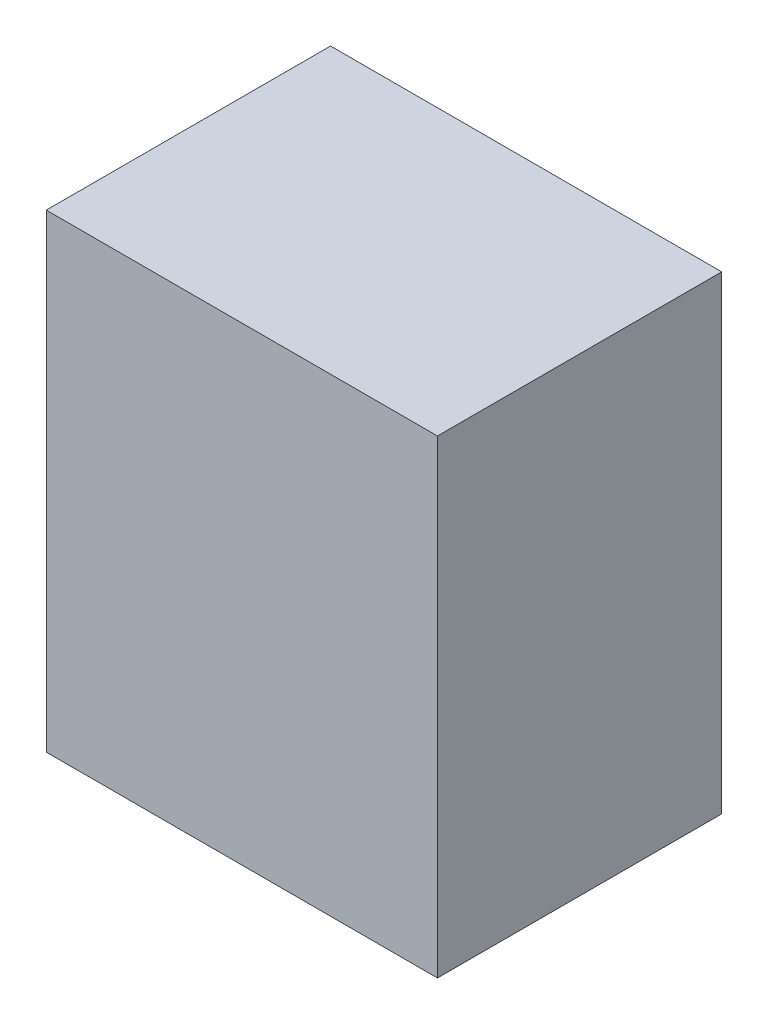
ISO-10303-21;
HEADER;
FILE_DESCRIPTION(('STEP AP214'),'2;1');
FILE_NAME('part.step','',(''),(''),'','','');
FILE_SCHEMA(('AUTOMOTIVE_DESIGN { 1 0 10303 214 1 1 1 1 }'));
ENDSEC;
DATA;
#1=APPLICATION_CONTEXT('core data for automotive mechanical design processes');
#2=APPLICATION_PROTOCOL_DEFINITION('international standard','automotive_design',2000,#1);
#3=PRODUCT_CONTEXT('',#1,'mechanical');
#4=PRODUCT('Part','Part','',(#3));
#5=PRODUCT_RELATED_PRODUCT_CATEGORY('part','',(#4));
#6=PRODUCT_DEFINITION_FORMATION('','',#4);
#7=PRODUCT_DEFINITION_CONTEXT('part definition',#1,'design');
#8=PRODUCT_DEFINITION('design','',#6,#7);
#9=PRODUCT_DEFINITION_SHAPE('','',#8);
#10=(LENGTH_UNIT() NAMED_UNIT(*) SI_UNIT(.MILLI.,.METRE.));
#11=(NAMED_UNIT(*) PLANE_ANGLE_UNIT() SI_UNIT($,.RADIAN.));
#12=(NAMED_UNIT(*) SI_UNIT($,.STERADIAN.) SOLID_ANGLE_UNIT());
#13=UNCERTAINTY_MEASURE_WITH_UNIT(LENGTH_MEASURE(1.E-05),#10,'distance_accuracy_value','');
#14=(GEOMETRIC_REPRESENTATION_CONTEXT(3) GLOBAL_UNCERTAINTY_ASSIGNED_CONTEXT((#13)) GLOBAL_UNIT_ASSIGNED_CONTEXT((#10,
#11,#12)) REPRESENTATION_CONTEXT('',''));
#15=CARTESIAN_POINT('',(0.,0.,0.));
#16=DIRECTION('',(0.,0.,1.));
#17=DIRECTION('',(1.,0.,0.));
#18=AXIS2_PLACEMENT_3D('',#15,#16,#17);
#19=CARTESIAN_POINT('',(0.,0.,27.686));
#20=DIRECTION('',(1.,0.,0.));
#21=DIRECTION('',(0.,0.,-1.));
#22=AXIS2_PLACEMENT_3D('',#19,#20,#21);
#23=PLANE('',#22);
#24=DIRECTION('',(0.,-1.,0.));
#25=VECTOR('',#24,1.);
#26=CARTESIAN_POINT('',(0.,0.,0.));
#27=LINE('',#26,#25);
#28=CARTESIAN_POINT('',(0.,45.72,0.));
#29=VERTEX_POINT('',#28);
#30=CARTESIAN_POINT('',(0.,0.,0.));
#31=VERTEX_POINT('',#30);
#32=EDGE_CURVE('E102',#29,#31,#27,.T.);
#33=ORIENTED_EDGE('',*,*,#32,.T.);
#34=DIRECTION('',(0.,0.,-1.));
#35=VECTOR('',#34,1.);
#36=CARTESIAN_POINT('',(0.,0.,27.686));
#37=LINE('',#36,#35);
#38=CARTESIAN_POINT('',(0.,0.,27.686));
#39=VERTEX_POINT('',#38);
#40=EDGE_CURVE('E11',#39,#31,#37,.T.);
#41=ORIENTED_EDGE('',*,*,#40,.F.);
#42=DIRECTION('',(0.,-1.,0.));
#43=VECTOR('',#42,1.);
#44=CARTESIAN_POINT('',(0.,0.,27.686));
#45=LINE('',#44,#43);
#46=CARTESIAN_POINT('',(0.,45.72,27.686));
#47=VERTEX_POINT('',#46);
#48=EDGE_CURVE('E90',#47,#39,#45,.T.);
#49=ORIENTED_EDGE('',*,*,#48,.F.);
#50=DIRECTION('',(0.,0.,-1.));
#51=VECTOR('',#50,1.);
#52=CARTESIAN_POINT('',(0.,45.72,27.686));
#53=LINE('',#52,#51);
#54=EDGE_CURVE('E98',#47,#29,#53,.T.);
#55=ORIENTED_EDGE('',*,*,#54,.T.);
#56=EDGE_LOOP('',(#33,#41,#49,#55));
#57=FACE_BOUND('',#56,.T.);
#58=ADVANCED_FACE('F39',(#57),#23,.F.);
#59=CARTESIAN_POINT('',(0.,0.,27.686));
#60=DIRECTION('',(0.,1.,0.));
#61=DIRECTION('',(0.,0.,1.));
#62=AXIS2_PLACEMENT_3D('',#59,#60,#61);
#63=PLANE('',#62);
#64=DIRECTION('',(1.,0.,0.));
#65=VECTOR('',#64,1.);
#66=CARTESIAN_POINT('',(0.,0.,0.));
#67=LINE('',#66,#65);
#68=CARTESIAN_POINT('',(38.1,0.,0.));
#69=VERTEX_POINT('',#68);
#70=EDGE_CURVE('E94',#31,#69,#67,.T.);
#71=ORIENTED_EDGE('',*,*,#70,.T.);
#72=DIRECTION('',(0.,0.,-1.));
#73=VECTOR('',#72,1.);
#74=CARTESIAN_POINT('',(38.1,0.,27.686));
#75=LINE('',#74,#73);
#76=CARTESIAN_POINT('',(38.1,0.,27.686));
#77=VERTEX_POINT('',#76);
#78=EDGE_CURVE('E47',#77,#69,#75,.T.);
#79=ORIENTED_EDGE('',*,*,#78,.F.);
#80=DIRECTION('',(1.,0.,0.));
#81=VECTOR('',#80,1.);
#82=CARTESIAN_POINT('',(0.,0.,27.686));
#83=LINE('',#82,#81);
#84=EDGE_CURVE('E85',#39,#77,#83,.T.);
#85=ORIENTED_EDGE('',*,*,#84,.F.);
#86=ORIENTED_EDGE('',*,*,#40,.T.);
#87=EDGE_LOOP('',(#71,#79,#85,#86));
#88=FACE_BOUND('',#87,.T.);
#89=ADVANCED_FACE('F93',(#88),#63,.F.);
#90=CARTESIAN_POINT('',(38.1,0.,27.686));
#91=DIRECTION('',(-1.,0.,0.));
#92=DIRECTION('',(0.,0.,1.));
#93=AXIS2_PLACEMENT_3D('',#90,#91,#92);
#94=PLANE('',#93);
#95=DIRECTION('',(0.,1.,0.));
#96=VECTOR('',#95,1.);
#97=CARTESIAN_POINT('',(38.1,0.,0.));
#98=LINE('',#97,#96);
#99=CARTESIAN_POINT('',(38.1,45.72,0.));
#100=VERTEX_POINT('',#99);
#101=EDGE_CURVE('E72',#69,#100,#98,.T.);
#102=ORIENTED_EDGE('',*,*,#101,.T.);
#103=DIRECTION('',(0.,0.,-1.));
#104=VECTOR('',#103,1.);
#105=CARTESIAN_POINT('',(38.1,45.72,27.686));
#106=LINE('',#105,#104);
#107=CARTESIAN_POINT('',(38.1,45.72,27.686));
#108=VERTEX_POINT('',#107);
#109=EDGE_CURVE('E95',#108,#100,#106,.T.);
#110=ORIENTED_EDGE('',*,*,#109,.F.);
#111=DIRECTION('',(0.,1.,0.));
#112=VECTOR('',#111,1.);
#113=CARTESIAN_POINT('',(38.1,0.,27.686));
#114=LINE('',#113,#112);
#115=EDGE_CURVE('E88',#77,#108,#114,.T.);
#116=ORIENTED_EDGE('',*,*,#115,.F.);
#117=ORIENTED_EDGE('',*,*,#78,.T.);
#118=EDGE_LOOP('',(#102,#110,#116,#117));
#119=FACE_BOUND('',#118,.T.);
#120=ADVANCED_FACE('F96',(#119),#94,.F.);
#121=CARTESIAN_POINT('',(0.,45.72,27.686));
#122=DIRECTION('',(0.,-1.,0.));
#123=DIRECTION('',(0.,0.,-1.));
#124=AXIS2_PLACEMENT_3D('',#121,#122,#123);
#125=PLANE('',#124);
#126=DIRECTION('',(-1.,0.,0.));
#127=VECTOR('',#126,1.);
#128=CARTESIAN_POINT('',(0.,45.72,0.));
#129=LINE('',#128,#127);
#130=EDGE_CURVE('E78',#100,#29,#129,.T.);
#131=ORIENTED_EDGE('',*,*,#130,.T.);
#132=ORIENTED_EDGE('',*,*,#54,.F.);
#133=DIRECTION('',(-1.,0.,0.));
#134=VECTOR('',#133,1.);
#135=CARTESIAN_POINT('',(0.,45.72,27.686));
#136=LINE('',#135,#134);
#137=EDGE_CURVE('E55',#108,#47,#136,.T.);
#138=ORIENTED_EDGE('',*,*,#137,.F.);
#139=ORIENTED_EDGE('',*,*,#109,.T.);
#140=EDGE_LOOP('',(#131,#132,#138,#139));
#141=FACE_BOUND('',#140,.T.);
#142=ADVANCED_FACE('F109',(#141),#125,.F.);
#143=CARTESIAN_POINT('',(0.,0.,27.686));
#144=DIRECTION('',(0.,0.,-1.));
#145=DIRECTION('',(-1.,0.,0.));
#146=AXIS2_PLACEMENT_3D('',#143,#144,#145);
#147=PLANE('',#146);
#148=ORIENTED_EDGE('',*,*,#48,.T.);
#149=ORIENTED_EDGE('',*,*,#84,.T.);
#150=ORIENTED_EDGE('',*,*,#115,.T.);
#151=ORIENTED_EDGE('',*,*,#137,.T.);
#152=EDGE_LOOP('',(#148,#149,#150,#151));
#153=FACE_BOUND('',#152,.T.);
#154=ADVANCED_FACE('F86',(#153),#147,.F.);
#155=CARTESIAN_POINT('',(0.,0.,0.));
#156=DIRECTION('',(0.,0.,-1.));
#157=DIRECTION('',(-1.,0.,0.));
#158=AXIS2_PLACEMENT_3D('',#155,#156,#157);
#159=PLANE('',#158);
#160=ORIENTED_EDGE('',*,*,#32,.F.);
#161=ORIENTED_EDGE('',*,*,#130,.F.);
#162=ORIENTED_EDGE('',*,*,#101,.F.);
#163=ORIENTED_EDGE('',*,*,#70,.F.);
#164=EDGE_LOOP('',(#160,#161,#162,#163));
#165=FACE_BOUND('',#164,.T.);
#166=ADVANCED_FACE('F112',(#165),#159,.T.);
#167=CLOSED_SHELL('',(#58,#89,#120,#142,#154,#166));
#168=MANIFOLD_SOLID_BREP('B2',#167);
#169=ADVANCED_BREP_SHAPE_REPRESENTATION('',(#18,#168),#14);
#170=SHAPE_DEFINITION_REPRESENTATION(#9,#169);
ENDSEC;
END-ISO-10303-21;
